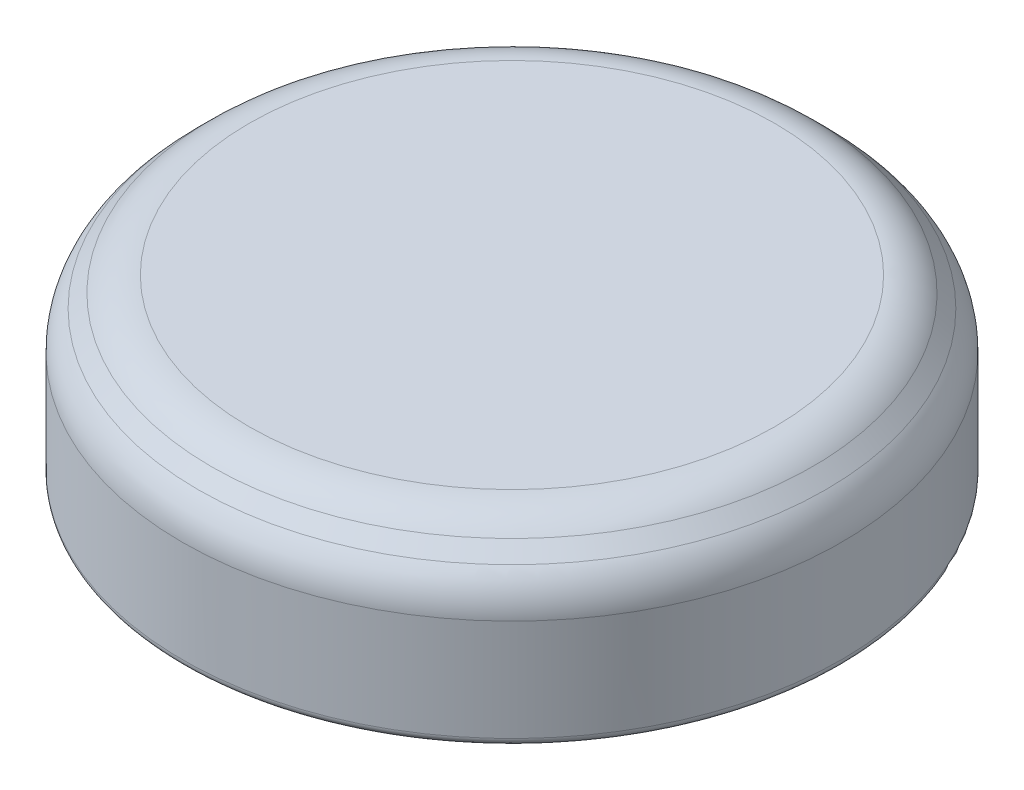
ISO-10303-21;
HEADER;
FILE_DESCRIPTION(('STEP AP214'),'2;1');
FILE_NAME('part.step','',(''),(''),'','','');
FILE_SCHEMA(('AUTOMOTIVE_DESIGN { 1 0 10303 214 1 1 1 1 }'));
ENDSEC;
DATA;
#1=APPLICATION_CONTEXT('core data for automotive mechanical design processes');
#2=APPLICATION_PROTOCOL_DEFINITION('international standard','automotive_design',2000,#1);
#3=PRODUCT_CONTEXT('',#1,'mechanical');
#4=PRODUCT('Part','Part','',(#3));
#5=PRODUCT_RELATED_PRODUCT_CATEGORY('part','',(#4));
#6=PRODUCT_DEFINITION_FORMATION('','',#4);
#7=PRODUCT_DEFINITION_CONTEXT('part definition',#1,'design');
#8=PRODUCT_DEFINITION('design','',#6,#7);
#9=PRODUCT_DEFINITION_SHAPE('','',#8);
#10=(LENGTH_UNIT() NAMED_UNIT(*) SI_UNIT(.MILLI.,.METRE.));
#11=(NAMED_UNIT(*) PLANE_ANGLE_UNIT() SI_UNIT($,.RADIAN.));
#12=(NAMED_UNIT(*) SI_UNIT($,.STERADIAN.) SOLID_ANGLE_UNIT());
#13=UNCERTAINTY_MEASURE_WITH_UNIT(LENGTH_MEASURE(1.E-05),#10,'distance_accuracy_value','');
#14=(GEOMETRIC_REPRESENTATION_CONTEXT(3) GLOBAL_UNCERTAINTY_ASSIGNED_CONTEXT((#13)) GLOBAL_UNIT_ASSIGNED_CONTEXT((#10,
#11,#12)) REPRESENTATION_CONTEXT('',''));
#15=CARTESIAN_POINT('',(0.,0.,0.));
#16=DIRECTION('',(0.,0.,1.));
#17=DIRECTION('',(1.,0.,0.));
#18=AXIS2_PLACEMENT_3D('',#15,#16,#17);
#19=CARTESIAN_POINT('',(0.,7.366,0.));
#20=DIRECTION('',(0.,-1.,0.));
#21=DIRECTION('',(0.,0.,-1.));
#22=AXIS2_PLACEMENT_3D('',#19,#20,#21);
#23=CYLINDRICAL_SURFACE('',#22,15.6591);
#24=CARTESIAN_POINT('',(0.,5.2107385309434,0.));
#25=DIRECTION('',(0.,1.,0.));
#26=DIRECTION('',(0.,0.,1.));
#27=AXIS2_PLACEMENT_3D('',#24,#25,#26);
#28=CIRCLE('',#27,15.6591);
#29=CARTESIAN_POINT('',(0.,5.2107385309434,15.6591));
#30=VERTEX_POINT('',#29);
#31=EDGE_CURVE('E53',#30,#30,#28,.F.);
#32=ORIENTED_EDGE('',*,*,#31,.T.);
#33=EDGE_LOOP('',(#32));
#34=FACE_BOUND('',#33,.T.);
#35=DIRECTION('',(0.,-1.,0.));
#36=VECTOR('',#35,1.);
#37=CARTESIAN_POINT('',(-2.54,7.366,-15.4517252373319));
#38=LINE('',#37,#36);
#39=CARTESIAN_POINT('',(-2.54,3.048,-15.4517252373319));
#40=VERTEX_POINT('',#39);
#41=CARTESIAN_POINT('',(-2.54,0.381,-15.4517252373319));
#42=VERTEX_POINT('',#41);
#43=EDGE_CURVE('E289',#40,#42,#38,.T.);
#44=ORIENTED_EDGE('',*,*,#43,.T.);
#45=CARTESIAN_POINT('',(0.,0.381,0.));
#46=DIRECTION('',(0.,1.,0.));
#47=DIRECTION('',(0.,0.,1.));
#48=AXIS2_PLACEMENT_3D('',#45,#46,#47);
#49=CIRCLE('',#48,15.6591);
#50=CARTESIAN_POINT('',(2.54,0.381,-15.4517252373319));
#51=VERTEX_POINT('',#50);
#52=EDGE_CURVE('E308',#42,#51,#49,.T.);
#53=ORIENTED_EDGE('',*,*,#52,.T.);
#54=DIRECTION('',(0.,-1.,0.));
#55=VECTOR('',#54,1.);
#56=CARTESIAN_POINT('',(2.54,7.366,-15.4517252373319));
#57=LINE('',#56,#55);
#58=CARTESIAN_POINT('',(2.54,3.048,-15.4517252373319));
#59=VERTEX_POINT('',#58);
#60=EDGE_CURVE('E278',#51,#59,#57,.F.);
#61=ORIENTED_EDGE('',*,*,#60,.T.);
#62=CARTESIAN_POINT('',(0.,3.048,0.));
#63=DIRECTION('',(0.,1.,0.));
#64=DIRECTION('',(0.,0.,1.));
#65=AXIS2_PLACEMENT_3D('',#62,#63,#64);
#66=CIRCLE('',#65,15.6591);
#67=EDGE_CURVE('E286',#59,#40,#66,.T.);
#68=ORIENTED_EDGE('',*,*,#67,.T.);
#69=EDGE_LOOP('',(#44,#53,#61,#68));
#70=FACE_BOUND('',#69,.T.);
#71=ADVANCED_FACE('F45',(#34,#70),#23,.T.);
#72=CARTESIAN_POINT('',(0.,8.382,0.));
#73=DIRECTION('',(0.,1.,0.));
#74=DIRECTION('',(0.,0.,1.));
#75=AXIS2_PLACEMENT_3D('',#72,#73,#74);
#76=PLANE('',#75);
#77=CARTESIAN_POINT('',(0.,8.382,0.));
#78=DIRECTION('',(0.,1.,0.));
#79=DIRECTION('',(0.,0.,1.));
#80=AXIS2_PLACEMENT_3D('',#77,#78,#79);
#81=CIRCLE('',#80,12.4878385309434);
#82=CARTESIAN_POINT('',(0.,8.382,12.4878385309434));
#83=VERTEX_POINT('',#82);
#84=EDGE_CURVE('E379',#83,#83,#81,.T.);
#85=ORIENTED_EDGE('',*,*,#84,.T.);
#86=EDGE_LOOP('',(#85));
#87=FACE_BOUND('',#86,.T.);
#88=ADVANCED_FACE('F398',(#87),#76,.T.);
#89=CARTESIAN_POINT('',(0.,0.,0.));
#90=DIRECTION('',(0.,1.,0.));
#91=DIRECTION('',(0.,0.,1.));
#92=AXIS2_PLACEMENT_3D('',#89,#90,#91);
#93=PLANE('',#92);
#94=DIRECTION('',(0.,0.,1.));
#95=VECTOR('',#94,1.);
#96=CARTESIAN_POINT('',(2.54,0.,-25.4));
#97=LINE('',#96,#95);
#98=CARTESIAN_POINT('',(2.54,0.,-15.0654817251225));
#99=VERTEX_POINT('',#98);
#100=CARTESIAN_POINT('',(2.54,0.,-14.421122619616));
#101=VERTEX_POINT('',#100);
#102=EDGE_CURVE('E282',#99,#101,#97,.T.);
#103=ORIENTED_EDGE('',*,*,#102,.F.);
#104=CARTESIAN_POINT('',(0.,0.,0.));
#105=DIRECTION('',(0.,1.,0.));
#106=DIRECTION('',(0.,0.,1.));
#107=AXIS2_PLACEMENT_3D('',#104,#105,#106);
#108=CIRCLE('',#107,15.2781);
#109=CARTESIAN_POINT('',(-2.54,0.,-15.0654817251225));
#110=VERTEX_POINT('',#109);
#111=EDGE_CURVE('E319',#99,#110,#108,.F.);
#112=ORIENTED_EDGE('',*,*,#111,.T.);
#113=DIRECTION('',(0.,0.,1.));
#114=VECTOR('',#113,1.);
#115=CARTESIAN_POINT('',(-2.54,0.,-25.4));
#116=LINE('',#115,#114);
#117=CARTESIAN_POINT('',(-2.54,0.,-14.421122619616));
#118=VERTEX_POINT('',#117);
#119=EDGE_CURVE('E270',#110,#118,#116,.T.);
#120=ORIENTED_EDGE('',*,*,#119,.T.);
#121=CARTESIAN_POINT('',(0.,0.,0.));
#122=DIRECTION('',(0.,1.,0.));
#123=DIRECTION('',(0.,0.,1.));
#124=AXIS2_PLACEMENT_3D('',#121,#122,#123);
#125=CIRCLE('',#124,14.6431);
#126=EDGE_CURVE('E292',#118,#101,#125,.T.);
#127=ORIENTED_EDGE('',*,*,#126,.T.);
#128=EDGE_LOOP('',(#103,#112,#120,#127));
#129=FACE_BOUND('',#128,.T.);
#130=ADVANCED_FACE('F403',(#129),#93,.F.);
#131=CARTESIAN_POINT('',(0.,8.08442048968553,0.));
#132=DIRECTION('',(0.,-1.,0.));
#133=DIRECTION('',(0.,0.,-1.));
#134=AXIS2_PLACEMENT_3D('',#131,#132,#133);
#135=CONICAL_SURFACE('',#134,13.8375204896855,0.785398163397448);
#136=CARTESIAN_POINT('',(0.,7.00678975515724,0.));
#137=DIRECTION('',(0.,-1.,0.));
#138=DIRECTION('',(0.,0.,-1.));
#139=AXIS2_PLACEMENT_3D('',#136,#137,#138);
#140=CIRCLE('',#139,14.9151512242138);
#141=CARTESIAN_POINT('',(0.,7.00678975515724,-14.9151512242138));
#142=VERTEX_POINT('',#141);
#143=EDGE_CURVE('E13',#142,#142,#140,.F.);
#144=ORIENTED_EDGE('',*,*,#143,.T.);
#145=EDGE_LOOP('',(#144));
#146=FACE_BOUND('',#145,.T.);
#147=CARTESIAN_POINT('',(0.,7.63805122421383,0.));
#148=DIRECTION('',(0.,1.,0.));
#149=DIRECTION('',(0.,0.,1.));
#150=AXIS2_PLACEMENT_3D('',#147,#148,#149);
#151=CIRCLE('',#150,14.2838897551572);
#152=CARTESIAN_POINT('',(0.,7.63805122421383,14.2838897551572));
#153=VERTEX_POINT('',#152);
#154=EDGE_CURVE('E382',#153,#153,#151,.F.);
#155=ORIENTED_EDGE('',*,*,#154,.T.);
#156=EDGE_LOOP('',(#155));
#157=FACE_BOUND('',#156,.T.);
#158=ADVANCED_FACE('F408',(#146,#157),#135,.T.);
#159=CARTESIAN_POINT('',(0.,7.366,0.));
#160=DIRECTION('',(0.,-1.,0.));
#161=DIRECTION('',(0.,0.,-1.));
#162=AXIS2_PLACEMENT_3D('',#159,#160,#161);
#163=CYLINDRICAL_SURFACE('',#162,14.6431);
#164=CARTESIAN_POINT('',(0.,4.064,0.));
#165=DIRECTION('',(0.,-1.,0.));
#166=DIRECTION('',(0.,0.,-1.));
#167=AXIS2_PLACEMENT_3D('',#164,#165,#166);
#168=CIRCLE('',#167,14.6431);
#169=CARTESIAN_POINT('',(-14.6217162715727,4.064,0.791069455627508));
#170=VERTEX_POINT('',#169);
#171=CARTESIAN_POINT('',(-14.6217162715727,4.064,-0.791069455627201));
#172=VERTEX_POINT('',#171);
#173=EDGE_CURVE('E377',#170,#172,#168,.T.);
#174=ORIENTED_EDGE('',*,*,#173,.F.);
#175=CARTESIAN_POINT('',(0.,19.1585044123123,0.));
#176=DIRECTION('',(0.,0.0523359562429438,0.998629534754574));
#177=DIRECTION('',(0.,-0.998629534754574,0.0523359562429438));
#178=AXIS2_PLACEMENT_3D('',#175,#176,#177);
#179=ELLIPSE('',#178,279.790435700203,14.6431);
#180=CARTESIAN_POINT('',(-14.6260123252327,5.6642,0.707206527218786));
#181=VERTEX_POINT('',#180);
#182=EDGE_CURVE('E375',#181,#170,#179,.T.);
#183=ORIENTED_EDGE('',*,*,#182,.F.);
#184=CARTESIAN_POINT('',(0.,5.6642,0.));
#185=DIRECTION('',(0.,1.,0.));
#186=DIRECTION('',(-1.,0.,0.));
#187=AXIS2_PLACEMENT_3D('',#184,#185,#186);
#188=CIRCLE('',#187,14.6431);
#189=CARTESIAN_POINT('',(-14.6260123252327,5.6642,-0.707206527218478));
#190=VERTEX_POINT('',#189);
#191=EDGE_CURVE('E373',#190,#181,#188,.T.);
#192=ORIENTED_EDGE('',*,*,#191,.F.);
#193=CARTESIAN_POINT('',(0.,19.1585044123123,0.));
#194=DIRECTION('',(0.,0.0523359562429438,-0.998629534754574));
#195=DIRECTION('',(0.,-0.998629534754574,-0.0523359562429438));
#196=AXIS2_PLACEMENT_3D('',#193,#194,#195);
#197=ELLIPSE('',#196,279.790435700203,14.6431);
#198=EDGE_CURVE('E191',#172,#190,#197,.T.);
#199=ORIENTED_EDGE('',*,*,#198,.F.);
#200=EDGE_LOOP('',(#174,#183,#192,#199));
#201=FACE_BOUND('',#200,.T.);
#202=CARTESIAN_POINT('',(0.,4.064,0.));
#203=DIRECTION('',(0.,-1.,0.));
#204=DIRECTION('',(0.,0.,-1.));
#205=AXIS2_PLACEMENT_3D('',#202,#203,#204);
#206=CIRCLE('',#205,14.6431);
#207=CARTESIAN_POINT('',(-0.791069455627355,4.064,-14.6217162715727));
#208=VERTEX_POINT('',#207);
#209=CARTESIAN_POINT('',(0.791069455627354,4.064,-14.6217162715727));
#210=VERTEX_POINT('',#209);
#211=EDGE_CURVE('E370',#208,#210,#206,.T.);
#212=ORIENTED_EDGE('',*,*,#211,.F.);
#213=CARTESIAN_POINT('',(0.,19.1585044123123,0.));
#214=DIRECTION('',(-0.998629534754574,0.0523359562429438,0.));
#215=DIRECTION('',(-0.0523359562429438,-0.998629534754574,0.));
#216=AXIS2_PLACEMENT_3D('',#213,#214,#215);
#217=ELLIPSE('',#216,279.790435700203,14.6431);
#218=CARTESIAN_POINT('',(-0.707206527218633,5.6642,-14.6260123252327));
#219=VERTEX_POINT('',#218);
#220=EDGE_CURVE('E368',#219,#208,#217,.T.);
#221=ORIENTED_EDGE('',*,*,#220,.F.);
#222=CARTESIAN_POINT('',(0.,5.6642,0.));
#223=DIRECTION('',(0.,1.,0.));
#224=DIRECTION('',(0.,0.,1.));
#225=AXIS2_PLACEMENT_3D('',#222,#223,#224);
#226=CIRCLE('',#225,14.6431);
#227=CARTESIAN_POINT('',(0.707206527218632,5.6642,-14.6260123252327));
#228=VERTEX_POINT('',#227);
#229=EDGE_CURVE('E366',#228,#219,#226,.T.);
#230=ORIENTED_EDGE('',*,*,#229,.F.);
#231=CARTESIAN_POINT('',(0.,19.1585044123123,0.));
#232=DIRECTION('',(0.998629534754574,0.0523359562429438,0.));
#233=DIRECTION('',(0.0523359562429438,-0.998629534754574,0.));
#234=AXIS2_PLACEMENT_3D('',#231,#232,#233);
#235=ELLIPSE('',#234,279.790435700203,14.6431);
#236=EDGE_CURVE('E364',#210,#228,#235,.T.);
#237=ORIENTED_EDGE('',*,*,#236,.F.);
#238=EDGE_LOOP('',(#212,#221,#230,#237));
#239=FACE_BOUND('',#238,.T.);
#240=CARTESIAN_POINT('',(0.,4.064,0.));
#241=DIRECTION('',(0.,-1.,0.));
#242=DIRECTION('',(0.,0.,-1.));
#243=AXIS2_PLACEMENT_3D('',#240,#241,#242);
#244=CIRCLE('',#243,14.6431);
#245=CARTESIAN_POINT('',(14.6217162715727,4.064,-0.791069455627406));
#246=VERTEX_POINT('',#245);
#247=CARTESIAN_POINT('',(14.6217162715727,4.064,0.791069455627303));
#248=VERTEX_POINT('',#247);
#249=EDGE_CURVE('E361',#246,#248,#244,.T.);
#250=ORIENTED_EDGE('',*,*,#249,.F.);
#251=CARTESIAN_POINT('',(0.,19.1585044123123,0.));
#252=DIRECTION('',(0.,0.0523359562429438,-0.998629534754574));
#253=DIRECTION('',(0.,-0.998629534754574,-0.0523359562429438));
#254=AXIS2_PLACEMENT_3D('',#251,#252,#253);
#255=ELLIPSE('',#254,279.790435700203,14.6431);
#256=CARTESIAN_POINT('',(14.6260123252327,5.6642,-0.707206527218684));
#257=VERTEX_POINT('',#256);
#258=EDGE_CURVE('E359',#257,#246,#255,.T.);
#259=ORIENTED_EDGE('',*,*,#258,.F.);
#260=CARTESIAN_POINT('',(0.,5.6642,0.));
#261=DIRECTION('',(0.,1.,0.));
#262=DIRECTION('',(-1.,0.,0.));
#263=AXIS2_PLACEMENT_3D('',#260,#261,#262);
#264=CIRCLE('',#263,14.6431);
#265=CARTESIAN_POINT('',(14.6260123252327,5.6642,0.707206527218581));
#266=VERTEX_POINT('',#265);
#267=EDGE_CURVE('E357',#266,#257,#264,.T.);
#268=ORIENTED_EDGE('',*,*,#267,.F.);
#269=CARTESIAN_POINT('',(0.,19.1585044123123,0.));
#270=DIRECTION('',(0.,0.0523359562429438,0.998629534754574));
#271=DIRECTION('',(0.,-0.998629534754574,0.0523359562429438));
#272=AXIS2_PLACEMENT_3D('',#269,#270,#271);
#273=ELLIPSE('',#272,279.790435700203,14.6431);
#274=EDGE_CURVE('E355',#248,#266,#273,.T.);
#275=ORIENTED_EDGE('',*,*,#274,.F.);
#276=EDGE_LOOP('',(#250,#259,#268,#275));
#277=FACE_BOUND('',#276,.T.);
#278=CARTESIAN_POINT('',(0.,4.064,0.));
#279=DIRECTION('',(0.,-1.,0.));
#280=DIRECTION('',(0.,0.,-1.));
#281=AXIS2_PLACEMENT_3D('',#278,#279,#280);
#282=CIRCLE('',#281,14.6431);
#283=CARTESIAN_POINT('',(0.791069455627355,4.064,14.6217162715727));
#284=VERTEX_POINT('',#283);
#285=CARTESIAN_POINT('',(-0.791069455627354,4.064,14.6217162715727));
#286=VERTEX_POINT('',#285);
#287=EDGE_CURVE('E352',#284,#286,#282,.T.);
#288=ORIENTED_EDGE('',*,*,#287,.F.);
#289=CARTESIAN_POINT('',(0.,19.1585044123123,0.));
#290=DIRECTION('',(0.998629534754574,0.0523359562429438,0.));
#291=DIRECTION('',(0.0523359562429438,-0.998629534754574,0.));
#292=AXIS2_PLACEMENT_3D('',#289,#290,#291);
#293=ELLIPSE('',#292,279.790435700203,14.6431);
#294=CARTESIAN_POINT('',(0.707206527218633,5.6642,14.6260123252327));
#295=VERTEX_POINT('',#294);
#296=EDGE_CURVE('E350',#295,#284,#293,.T.);
#297=ORIENTED_EDGE('',*,*,#296,.F.);
#298=CARTESIAN_POINT('',(0.,5.6642,0.));
#299=DIRECTION('',(0.,1.,0.));
#300=DIRECTION('',(0.,0.,1.));
#301=AXIS2_PLACEMENT_3D('',#298,#299,#300);
#302=CIRCLE('',#301,14.6431);
#303=CARTESIAN_POINT('',(-0.707206527218632,5.6642,14.6260123252327));
#304=VERTEX_POINT('',#303);
#305=EDGE_CURVE('E348',#304,#295,#302,.T.);
#306=ORIENTED_EDGE('',*,*,#305,.F.);
#307=CARTESIAN_POINT('',(0.,19.1585044123123,0.));
#308=DIRECTION('',(-0.998629534754574,0.0523359562429438,0.));
#309=DIRECTION('',(-0.0523359562429438,-0.998629534754574,0.));
#310=AXIS2_PLACEMENT_3D('',#307,#308,#309);
#311=ELLIPSE('',#310,279.790435700203,14.6431);
#312=EDGE_CURVE('E346',#286,#304,#311,.T.);
#313=ORIENTED_EDGE('',*,*,#312,.F.);
#314=EDGE_LOOP('',(#288,#297,#306,#313));
#315=FACE_BOUND('',#314,.T.);
#316=DIRECTION('',(0.,-1.,0.));
#317=VECTOR('',#316,1.);
#318=CARTESIAN_POINT('',(-2.54,7.366,-14.421122619616));
#319=LINE('',#318,#317);
#320=CARTESIAN_POINT('',(-2.54,3.048,-14.421122619616));
#321=VERTEX_POINT('',#320);
#322=EDGE_CURVE('E305',#321,#118,#319,.T.);
#323=ORIENTED_EDGE('',*,*,#322,.F.);
#324=CARTESIAN_POINT('',(0.,3.048,0.));
#325=DIRECTION('',(0.,1.,0.));
#326=DIRECTION('',(0.,0.,1.));
#327=AXIS2_PLACEMENT_3D('',#324,#325,#326);
#328=CIRCLE('',#327,14.6431);
#329=CARTESIAN_POINT('',(2.54,3.048,-14.421122619616));
#330=VERTEX_POINT('',#329);
#331=EDGE_CURVE('E303',#330,#321,#328,.T.);
#332=ORIENTED_EDGE('',*,*,#331,.F.);
#333=DIRECTION('',(0.,-1.,0.));
#334=VECTOR('',#333,1.);
#335=CARTESIAN_POINT('',(2.54,7.366,-14.421122619616));
#336=LINE('',#335,#334);
#337=EDGE_CURVE('E301',#101,#330,#336,.F.);
#338=ORIENTED_EDGE('',*,*,#337,.F.);
#339=ORIENTED_EDGE('',*,*,#126,.F.);
#340=EDGE_LOOP('',(#323,#332,#338,#339));
#341=FACE_BOUND('',#340,.T.);
#342=CARTESIAN_POINT('',(0.,5.842,0.));
#343=DIRECTION('',(0.,1.,0.));
#344=DIRECTION('',(0.,0.,1.));
#345=AXIS2_PLACEMENT_3D('',#342,#343,#344);
#346=CIRCLE('',#345,14.6431);
#347=CARTESIAN_POINT('',(0.,5.842,14.6431));
#348=VERTEX_POINT('',#347);
#349=EDGE_CURVE('E298',#348,#348,#346,.F.);
#350=ORIENTED_EDGE('',*,*,#349,.F.);
#351=EDGE_LOOP('',(#350));
#352=FACE_BOUND('',#351,.T.);
#353=ADVANCED_FACE('F410',(#201,#239,#277,#315,#341,#352),#163,.F.);
#354=CARTESIAN_POINT('',(0.,7.366,0.));
#355=DIRECTION('',(0.,1.,0.));
#356=DIRECTION('',(0.,0.,1.));
#357=AXIS2_PLACEMENT_3D('',#354,#355,#356);
#358=PLANE('',#357);
#359=CARTESIAN_POINT('',(0.,7.366,0.));
#360=DIRECTION('',(0.,1.,0.));
#361=DIRECTION('',(0.,0.,1.));
#362=AXIS2_PLACEMENT_3D('',#359,#360,#361);
#363=CIRCLE('',#362,13.1191);
#364=CARTESIAN_POINT('',(0.,7.366,13.1191));
#365=VERTEX_POINT('',#364);
#366=EDGE_CURVE('E295',#365,#365,#363,.T.);
#367=ORIENTED_EDGE('',*,*,#366,.F.);
#368=EDGE_LOOP('',(#367));
#369=FACE_BOUND('',#368,.T.);
#370=ADVANCED_FACE('F338',(#369),#358,.F.);
#371=CARTESIAN_POINT('',(0.,7.366,0.));
#372=DIRECTION('',(0.,-1.,0.));
#373=DIRECTION('',(0.,0.,-1.));
#374=AXIS2_PLACEMENT_3D('',#371,#372,#373);
#375=CONICAL_SURFACE('',#374,13.1191,0.785398163397448);
#376=ORIENTED_EDGE('',*,*,#349,.T.);
#377=EDGE_LOOP('',(#376));
#378=FACE_BOUND('',#377,.T.);
#379=ORIENTED_EDGE('',*,*,#366,.T.);
#380=EDGE_LOOP('',(#379));
#381=FACE_BOUND('',#380,.T.);
#382=ADVANCED_FACE('F336',(#378,#381),#375,.F.);
#383=CARTESIAN_POINT('',(-2.54,0.,-25.4));
#384=DIRECTION('',(-1.,0.,0.));
#385=DIRECTION('',(0.,-1.,0.));
#386=AXIS2_PLACEMENT_3D('',#383,#384,#385);
#387=PLANE('',#386);
#388=ORIENTED_EDGE('',*,*,#119,.F.);
#389=CARTESIAN_POINT('',(-2.54,0.,-15.0654817251225));
#390=CARTESIAN_POINT('',(-2.54,-1.7225422317726E-05,-15.0874335175876));
#391=CARTESIAN_POINT('',(-2.54,0.00184376258465478,-15.1093818382942));
#392=CARTESIAN_POINT('',(-2.54,0.00919882073363558,-15.1526533495357));
#393=CARTESIAN_POINT('',(-2.54,0.0146915700603824,-15.173976764396));
#394=CARTESIAN_POINT('',(-2.54,0.0291915571867706,-15.2154102263428));
#395=CARTESIAN_POINT('',(-2.54,0.038201016472197,-15.2355194971716));
#396=CARTESIAN_POINT('',(-2.54,0.0594868787289595,-15.2739209705587));
#397=CARTESIAN_POINT('',(-2.54,0.0717623099228591,-15.2922137113988));
#398=CARTESIAN_POINT('',(-2.54,0.0991551906744815,-15.3263300304729));
#399=CARTESIAN_POINT('',(-2.54,0.114253082413145,-15.342169305227));
#400=CARTESIAN_POINT('',(-2.54,0.146929104454111,-15.371051020832));
#401=CARTESIAN_POINT('',(-2.54,0.164507650988168,-15.3840929913928));
#402=CARTESIAN_POINT('',(-2.54,0.201398605825968,-15.4068256371085));
#403=CARTESIAN_POINT('',(-2.54,0.220685867512697,-15.4165571730314));
#404=CARTESIAN_POINT('',(-2.54,0.26062876436647,-15.4325935498973));
#405=CARTESIAN_POINT('',(-2.54,0.281283319454961,-15.4389010602127));
#406=CARTESIAN_POINT('',(-2.54,0.315241896564794,-15.4461673332976));
#407=CARTESIAN_POINT('',(-2.54,0.328315796659932,-15.4482503498726));
#408=CARTESIAN_POINT('',(-2.54,0.354591129350472,-15.4510289629907));
#409=CARTESIAN_POINT('',(-2.54,0.367792351298367,-15.4517265521848));
#410=CARTESIAN_POINT('',(-2.54,0.380999999999797,-15.4517252373329));
#411=B_SPLINE_CURVE_WITH_KNOTS('',3,(#389,#390,#391,#392,#393,#394,#395,#396,#397,#398,#399,
#400,#401,#402,#403,#404,#405,#406,#407,#408,#409,#410),.UNSPECIFIED.,.F.,.F.,(4,2,2,2,2,2,2,2,
2,2,4),(0.,0.0657720126096408,0.131520118105964,0.197309823698158,0.263079975665277,
0.328410227796389,0.39375145482387,0.458254127073134,0.522706440521001,0.562355500632072,
0.601947492340685),.UNSPECIFIED.);
#412=EDGE_CURVE('E340',#110,#42,#411,.T.);
#413=ORIENTED_EDGE('',*,*,#412,.T.);
#414=ORIENTED_EDGE('',*,*,#43,.F.);
#415=DIRECTION('',(0.,0.,1.));
#416=VECTOR('',#415,1.);
#417=CARTESIAN_POINT('',(-2.54,3.048,-25.4));
#418=LINE('',#417,#416);
#419=EDGE_CURVE('E275',#40,#321,#418,.T.);
#420=ORIENTED_EDGE('',*,*,#419,.T.);
#421=ORIENTED_EDGE('',*,*,#322,.T.);
#422=EDGE_LOOP('',(#388,#413,#414,#420,#421));
#423=FACE_BOUND('',#422,.T.);
#424=ADVANCED_FACE('F332',(#423),#387,.F.);
#425=CARTESIAN_POINT('',(-2.54,3.048,-25.4));
#426=DIRECTION('',(0.,1.,0.));
#427=DIRECTION('',(0.,0.,1.));
#428=AXIS2_PLACEMENT_3D('',#425,#426,#427);
#429=PLANE('',#428);
#430=DIRECTION('',(0.,0.,1.));
#431=VECTOR('',#430,1.);
#432=CARTESIAN_POINT('',(2.54,3.048,-25.4));
#433=LINE('',#432,#431);
#434=EDGE_CURVE('E279',#59,#330,#433,.T.);
#435=ORIENTED_EDGE('',*,*,#434,.T.);
#436=ORIENTED_EDGE('',*,*,#331,.T.);
#437=ORIENTED_EDGE('',*,*,#419,.F.);
#438=ORIENTED_EDGE('',*,*,#67,.F.);
#439=EDGE_LOOP('',(#435,#436,#437,#438));
#440=FACE_BOUND('',#439,.T.);
#441=ADVANCED_FACE('F329',(#440),#429,.F.);
#442=CARTESIAN_POINT('',(2.54,0.,-25.4));
#443=DIRECTION('',(1.,0.,0.));
#444=DIRECTION('',(0.,1.,0.));
#445=AXIS2_PLACEMENT_3D('',#442,#443,#444);
#446=PLANE('',#445);
#447=ORIENTED_EDGE('',*,*,#60,.F.);
#448=CARTESIAN_POINT('',(2.54,0.381,-15.4517252373319));
#449=CARTESIAN_POINT('',(2.54,0.359772490891304,-15.4517445966209));
#450=CARTESIAN_POINT('',(2.54,0.338552065598667,-15.4499285919333));
#451=CARTESIAN_POINT('',(2.54,0.296738615147839,-15.4427706701231));
#452=CARTESIAN_POINT('',(2.54,0.276144893476584,-15.4374328289169));
#453=CARTESIAN_POINT('',(2.54,0.236139244993674,-15.423372955196));
#454=CARTESIAN_POINT('',(2.54,0.216727738558609,-15.4146497269274));
#455=CARTESIAN_POINT('',(2.54,0.179634954507946,-15.3940883898612));
#456=CARTESIAN_POINT('',(2.54,0.161953551564202,-15.3822505069177));
#457=CARTESIAN_POINT('',(2.54,0.128705585184498,-15.3557305831975));
#458=CARTESIAN_POINT('',(2.54,0.113151656785205,-15.3410327083369));
#459=CARTESIAN_POINT('',(2.54,0.0846921536658857,-15.3092604523183));
#460=CARTESIAN_POINT('',(2.54,0.0717871500032159,-15.2921855600495));
#461=CARTESIAN_POINT('',(2.54,0.0488197071337167,-15.2559162402967));
#462=CARTESIAN_POINT('',(2.54,0.0387955636956408,-15.236697588268));
#463=CARTESIAN_POINT('',(2.54,0.0220747214168535,-15.1968671141949));
#464=CARTESIAN_POINT('',(2.54,0.0153767301925501,-15.1762558368001));
#465=CARTESIAN_POINT('',(2.54,0.00696106685302003,-15.1405387495994));
#466=CARTESIAN_POINT('',(2.54,0.00435210173695095,-15.1256364320892));
#467=CARTESIAN_POINT('',(2.54,0.000871658125725568,-15.0956517892088));
#468=CARTESIAN_POINT('',(2.54,-2.28805720678941E-06,-15.0805697502337));
#469=CARTESIAN_POINT('',(2.54,0.,-15.0654817251225));
#470=B_SPLINE_CURVE_WITH_KNOTS('',3,(#448,#449,#450,#451,#452,#453,#454,#455,#456,#457,#458,
#459,#460,#461,#462,#463,#464,#465,#466,#467,#468,#469),.UNSPECIFIED.,.F.,.F.,(4,2,2,2,2,2,2,2,
2,2,4),(0.,0.0635945245725837,0.127115578283884,0.190659088740896,0.2541979927132,
0.318099232539739,0.382014233812814,0.446743248535656,0.511447092943298,0.556738675021806,
0.60196579337516),.UNSPECIFIED.);
#471=EDGE_CURVE('E311',#51,#99,#470,.T.);
#472=ORIENTED_EDGE('',*,*,#471,.T.);
#473=ORIENTED_EDGE('',*,*,#102,.T.);
#474=ORIENTED_EDGE('',*,*,#337,.T.);
#475=ORIENTED_EDGE('',*,*,#434,.F.);
#476=EDGE_LOOP('',(#447,#472,#473,#474,#475));
#477=FACE_BOUND('',#476,.T.);
#478=ADVANCED_FACE('F324',(#477),#446,.F.);
#479=CARTESIAN_POINT('',(0.,0.381,0.));
#480=DIRECTION('',(0.,1.,0.));
#481=DIRECTION('',(0.,0.,1.));
#482=AXIS2_PLACEMENT_3D('',#479,#480,#481);
#483=TOROIDAL_SURFACE('',#482,15.2781,0.381);
#484=ORIENTED_EDGE('',*,*,#412,.F.);
#485=ORIENTED_EDGE('',*,*,#111,.F.);
#486=ORIENTED_EDGE('',*,*,#471,.F.);
#487=ORIENTED_EDGE('',*,*,#52,.F.);
#488=EDGE_LOOP('',(#484,#485,#486,#487));
#489=FACE_BOUND('',#488,.T.);
#490=ADVANCED_FACE('F321',(#489),#483,.T.);
#491=CARTESIAN_POINT('',(0.,4.064,14.351));
#492=DIRECTION('',(0.,-1.,0.));
#493=DIRECTION('',(0.,0.,-1.));
#494=AXIS2_PLACEMENT_3D('',#491,#492,#493);
#495=PLANE('',#494);
#496=ORIENTED_EDGE('',*,*,#287,.T.);
#497=DIRECTION('',(0.,0.,-1.));
#498=VECTOR('',#497,1.);
#499=CARTESIAN_POINT('',(-0.791069455627354,4.064,14.2621));
#500=LINE('',#499,#498);
#501=CARTESIAN_POINT('',(-0.791069455627354,4.064,15.1892));
#502=VERTEX_POINT('',#501);
#503=EDGE_CURVE('E266',#502,#286,#500,.T.);
#504=ORIENTED_EDGE('',*,*,#503,.F.);
#505=DIRECTION('',(-1.,0.,0.));
#506=VECTOR('',#505,1.);
#507=CARTESIAN_POINT('',(0.,4.064,15.1892));
#508=LINE('',#507,#506);
#509=CARTESIAN_POINT('',(0.791069455627355,4.064,15.1892));
#510=VERTEX_POINT('',#509);
#511=EDGE_CURVE('E271',#510,#502,#508,.T.);
#512=ORIENTED_EDGE('',*,*,#511,.F.);
#513=DIRECTION('',(0.,0.,1.));
#514=VECTOR('',#513,1.);
#515=CARTESIAN_POINT('',(0.791069455627355,4.064,14.2621));
#516=LINE('',#515,#514);
#517=EDGE_CURVE('E268',#284,#510,#516,.T.);
#518=ORIENTED_EDGE('',*,*,#517,.F.);
#519=EDGE_LOOP('',(#496,#504,#512,#518));
#520=FACE_BOUND('',#519,.T.);
#521=ADVANCED_FACE('F475',(#520),#495,.F.);
#522=CARTESIAN_POINT('',(0.707206527218633,5.6642,14.2621));
#523=DIRECTION('',(0.998629534754574,0.0523359562429438,0.));
#524=DIRECTION('',(0.0523359562429438,-0.998629534754574,0.));
#525=AXIS2_PLACEMENT_3D('',#522,#523,#524);
#526=PLANE('',#525);
#527=ORIENTED_EDGE('',*,*,#296,.T.);
#528=ORIENTED_EDGE('',*,*,#517,.T.);
#529=DIRECTION('',(0.0523359562429438,-0.998629534754574,0.));
#530=VECTOR('',#529,1.);
#531=CARTESIAN_POINT('',(0.705269451542461,5.70116160575151,15.1892));
#532=LINE('',#531,#530);
#533=CARTESIAN_POINT('',(0.707206527218633,5.6642,15.1892));
#534=VERTEX_POINT('',#533);
#535=EDGE_CURVE('E263',#534,#510,#532,.T.);
#536=ORIENTED_EDGE('',*,*,#535,.F.);
#537=DIRECTION('',(0.,0.,-1.));
#538=VECTOR('',#537,1.);
#539=CARTESIAN_POINT('',(0.707206527218633,5.6642,14.2621));
#540=LINE('',#539,#538);
#541=EDGE_CURVE('E251',#534,#295,#540,.T.);
#542=ORIENTED_EDGE('',*,*,#541,.T.);
#543=EDGE_LOOP('',(#527,#528,#536,#542));
#544=FACE_BOUND('',#543,.T.);
#545=ADVANCED_FACE('F481',(#544),#526,.F.);
#546=CARTESIAN_POINT('',(0.,5.6642,15.1892));
#547=DIRECTION('',(0.,0.,1.));
#548=DIRECTION('',(0.,-1.,0.));
#549=AXIS2_PLACEMENT_3D('',#546,#547,#548);
#550=PLANE('',#549);
#551=ORIENTED_EDGE('',*,*,#535,.T.);
#552=ORIENTED_EDGE('',*,*,#511,.T.);
#553=DIRECTION('',(-0.0523359562429438,-0.998629534754574,0.));
#554=VECTOR('',#553,1.);
#555=CARTESIAN_POINT('',(-0.707206527218632,5.6642,15.1892));
#556=LINE('',#555,#554);
#557=CARTESIAN_POINT('',(-0.707206527218632,5.6642,15.1892));
#558=VERTEX_POINT('',#557);
#559=EDGE_CURVE('E258',#558,#502,#556,.T.);
#560=ORIENTED_EDGE('',*,*,#559,.F.);
#561=DIRECTION('',(1.,0.,0.));
#562=VECTOR('',#561,1.);
#563=CARTESIAN_POINT('',(0.,5.6642,15.1892));
#564=LINE('',#563,#562);
#565=EDGE_CURVE('E259',#558,#534,#564,.T.);
#566=ORIENTED_EDGE('',*,*,#565,.T.);
#567=EDGE_LOOP('',(#551,#552,#560,#566));
#568=FACE_BOUND('',#567,.T.);
#569=ADVANCED_FACE('F488',(#568),#550,.F.);
#570=CARTESIAN_POINT('',(0.,5.6642,14.2621));
#571=DIRECTION('',(0.,1.,0.));
#572=DIRECTION('',(1.,0.,0.));
#573=AXIS2_PLACEMENT_3D('',#570,#571,#572);
#574=PLANE('',#573);
#575=ORIENTED_EDGE('',*,*,#305,.T.);
#576=ORIENTED_EDGE('',*,*,#541,.F.);
#577=ORIENTED_EDGE('',*,*,#565,.F.);
#578=DIRECTION('',(0.,0.,1.));
#579=VECTOR('',#578,1.);
#580=CARTESIAN_POINT('',(-0.707206527218632,5.6642,14.2621));
#581=LINE('',#580,#579);
#582=EDGE_CURVE('E256',#304,#558,#581,.T.);
#583=ORIENTED_EDGE('',*,*,#582,.F.);
#584=EDGE_LOOP('',(#575,#576,#577,#583));
#585=FACE_BOUND('',#584,.T.);
#586=ADVANCED_FACE('F496',(#585),#574,.F.);
#587=CARTESIAN_POINT('',(-0.707206527218632,5.6642,14.2621));
#588=DIRECTION('',(-0.998629534754574,0.0523359562429438,0.));
#589=DIRECTION('',(0.0523359562429438,0.998629534754574,0.));
#590=AXIS2_PLACEMENT_3D('',#587,#588,#589);
#591=PLANE('',#590);
#592=ORIENTED_EDGE('',*,*,#312,.T.);
#593=ORIENTED_EDGE('',*,*,#582,.T.);
#594=ORIENTED_EDGE('',*,*,#559,.T.);
#595=ORIENTED_EDGE('',*,*,#503,.T.);
#596=EDGE_LOOP('',(#592,#593,#594,#595));
#597=FACE_BOUND('',#596,.T.);
#598=ADVANCED_FACE('F504',(#597),#591,.F.);
#599=CARTESIAN_POINT('',(14.351,4.064,0.));
#600=DIRECTION('',(0.,-1.,0.));
#601=DIRECTION('',(-1.,0.,0.));
#602=AXIS2_PLACEMENT_3D('',#599,#600,#601);
#603=PLANE('',#602);
#604=ORIENTED_EDGE('',*,*,#249,.T.);
#605=DIRECTION('',(-1.,0.,0.));
#606=VECTOR('',#605,1.);
#607=CARTESIAN_POINT('',(14.2621,4.064,0.791069455627304));
#608=LINE('',#607,#606);
#609=CARTESIAN_POINT('',(15.1892,4.064,0.791069455627301));
#610=VERTEX_POINT('',#609);
#611=EDGE_CURVE('E247',#610,#248,#608,.T.);
#612=ORIENTED_EDGE('',*,*,#611,.F.);
#613=DIRECTION('',(0.,0.,1.));
#614=VECTOR('',#613,1.);
#615=CARTESIAN_POINT('',(15.1892,4.064,0.));
#616=LINE('',#615,#614);
#617=CARTESIAN_POINT('',(15.1892,4.064,-0.791069455627408));
#618=VERTEX_POINT('',#617);
#619=EDGE_CURVE('E252',#618,#610,#616,.T.);
#620=ORIENTED_EDGE('',*,*,#619,.F.);
#621=DIRECTION('',(1.,0.,0.));
#622=VECTOR('',#621,1.);
#623=CARTESIAN_POINT('',(14.2621,4.064,-0.791069455627405));
#624=LINE('',#623,#622);
#625=EDGE_CURVE('E249',#246,#618,#624,.T.);
#626=ORIENTED_EDGE('',*,*,#625,.F.);
#627=EDGE_LOOP('',(#604,#612,#620,#626));
#628=FACE_BOUND('',#627,.T.);
#629=ADVANCED_FACE('F512',(#628),#603,.F.);
#630=CARTESIAN_POINT('',(14.2621,5.6642,-0.707206527218682));
#631=DIRECTION('',(0.,0.0523359562429438,-0.998629534754574));
#632=DIRECTION('',(0.,-0.998629534754574,-0.0523359562429438));
#633=AXIS2_PLACEMENT_3D('',#630,#631,#632);
#634=PLANE('',#633);
#635=ORIENTED_EDGE('',*,*,#258,.T.);
#636=ORIENTED_EDGE('',*,*,#625,.T.);
#637=DIRECTION('',(0.,-0.998629534754574,-0.0523359562429438));
#638=VECTOR('',#637,1.);
#639=CARTESIAN_POINT('',(15.1892,5.70116160575151,-0.705269451542514));
#640=LINE('',#639,#638);
#641=CARTESIAN_POINT('',(15.1892,5.6642,-0.707206527218686));
#642=VERTEX_POINT('',#641);
#643=EDGE_CURVE('E244',#642,#618,#640,.T.);
#644=ORIENTED_EDGE('',*,*,#643,.F.);
#645=DIRECTION('',(-1.,0.,0.));
#646=VECTOR('',#645,1.);
#647=CARTESIAN_POINT('',(14.2621,5.6642,-0.707206527218682));
#648=LINE('',#647,#646);
#649=EDGE_CURVE('E232',#642,#257,#648,.T.);
#650=ORIENTED_EDGE('',*,*,#649,.T.);
#651=EDGE_LOOP('',(#635,#636,#644,#650));
#652=FACE_BOUND('',#651,.T.);
#653=ADVANCED_FACE('F520',(#652),#634,.F.);
#654=CARTESIAN_POINT('',(15.1892,5.6642,0.));
#655=DIRECTION('',(1.,0.,0.));
#656=DIRECTION('',(0.,-1.,0.));
#657=AXIS2_PLACEMENT_3D('',#654,#655,#656);
#658=PLANE('',#657);
#659=ORIENTED_EDGE('',*,*,#643,.T.);
#660=ORIENTED_EDGE('',*,*,#619,.T.);
#661=DIRECTION('',(0.,-0.998629534754574,0.0523359562429438));
#662=VECTOR('',#661,1.);
#663=CARTESIAN_POINT('',(15.1892,5.6642,0.707206527218579));
#664=LINE('',#663,#662);
#665=CARTESIAN_POINT('',(15.1892,5.6642,0.707206527218579));
#666=VERTEX_POINT('',#665);
#667=EDGE_CURVE('E239',#666,#610,#664,.T.);
#668=ORIENTED_EDGE('',*,*,#667,.F.);
#669=DIRECTION('',(0.,0.,-1.));
#670=VECTOR('',#669,1.);
#671=CARTESIAN_POINT('',(15.1892,5.6642,0.));
#672=LINE('',#671,#670);
#673=EDGE_CURVE('E240',#666,#642,#672,.T.);
#674=ORIENTED_EDGE('',*,*,#673,.T.);
#675=EDGE_LOOP('',(#659,#660,#668,#674));
#676=FACE_BOUND('',#675,.T.);
#677=ADVANCED_FACE('F528',(#676),#658,.F.);
#678=CARTESIAN_POINT('',(14.2621,5.6642,0.));
#679=DIRECTION('',(0.,1.,0.));
#680=DIRECTION('',(0.,0.,-1.));
#681=AXIS2_PLACEMENT_3D('',#678,#679,#680);
#682=PLANE('',#681);
#683=ORIENTED_EDGE('',*,*,#267,.T.);
#684=ORIENTED_EDGE('',*,*,#649,.F.);
#685=ORIENTED_EDGE('',*,*,#673,.F.);
#686=DIRECTION('',(1.,0.,0.));
#687=VECTOR('',#686,1.);
#688=CARTESIAN_POINT('',(14.2621,5.6642,0.707206527218582));
#689=LINE('',#688,#687);
#690=EDGE_CURVE('E237',#266,#666,#689,.T.);
#691=ORIENTED_EDGE('',*,*,#690,.F.);
#692=EDGE_LOOP('',(#683,#684,#685,#691));
#693=FACE_BOUND('',#692,.T.);
#694=ADVANCED_FACE('F536',(#693),#682,.F.);
#695=CARTESIAN_POINT('',(14.2621,5.6642,0.707206527218582));
#696=DIRECTION('',(0.,0.0523359562429438,0.998629534754574));
#697=DIRECTION('',(0.,0.998629534754574,-0.0523359562429438));
#698=AXIS2_PLACEMENT_3D('',#695,#696,#697);
#699=PLANE('',#698);
#700=ORIENTED_EDGE('',*,*,#274,.T.);
#701=ORIENTED_EDGE('',*,*,#690,.T.);
#702=ORIENTED_EDGE('',*,*,#667,.T.);
#703=ORIENTED_EDGE('',*,*,#611,.T.);
#704=EDGE_LOOP('',(#700,#701,#702,#703));
#705=FACE_BOUND('',#704,.T.);
#706=ADVANCED_FACE('F544',(#705),#699,.F.);
#707=CARTESIAN_POINT('',(0.,4.064,-14.351));
#708=DIRECTION('',(0.,-1.,0.));
#709=DIRECTION('',(0.,0.,1.));
#710=AXIS2_PLACEMENT_3D('',#707,#708,#709);
#711=PLANE('',#710);
#712=ORIENTED_EDGE('',*,*,#211,.T.);
#713=DIRECTION('',(0.,0.,1.));
#714=VECTOR('',#713,1.);
#715=CARTESIAN_POINT('',(0.791069455627354,4.064,-14.2621));
#716=LINE('',#715,#714);
#717=CARTESIAN_POINT('',(0.791069455627354,4.064,-15.1892));
#718=VERTEX_POINT('',#717);
#719=EDGE_CURVE('E68',#718,#210,#716,.T.);
#720=ORIENTED_EDGE('',*,*,#719,.F.);
#721=DIRECTION('',(1.,0.,0.));
#722=VECTOR('',#721,1.);
#723=CARTESIAN_POINT('',(0.,4.064,-15.1892));
#724=LINE('',#723,#722);
#725=CARTESIAN_POINT('',(-0.791069455627355,4.064,-15.1892));
#726=VERTEX_POINT('',#725);
#727=EDGE_CURVE('E233',#726,#718,#724,.T.);
#728=ORIENTED_EDGE('',*,*,#727,.F.);
#729=DIRECTION('',(0.,0.,-1.));
#730=VECTOR('',#729,1.);
#731=CARTESIAN_POINT('',(-0.791069455627355,4.064,-14.2621));
#732=LINE('',#731,#730);
#733=EDGE_CURVE('E230',#208,#726,#732,.T.);
#734=ORIENTED_EDGE('',*,*,#733,.F.);
#735=EDGE_LOOP('',(#712,#720,#728,#734));
#736=FACE_BOUND('',#735,.T.);
#737=ADVANCED_FACE('F552',(#736),#711,.F.);
#738=CARTESIAN_POINT('',(-0.707206527218633,5.6642,-14.2621));
#739=DIRECTION('',(-0.998629534754574,0.0523359562429438,0.));
#740=DIRECTION('',(-0.0523359562429438,-0.998629534754574,0.));
#741=AXIS2_PLACEMENT_3D('',#738,#739,#740);
#742=PLANE('',#741);
#743=ORIENTED_EDGE('',*,*,#220,.T.);
#744=ORIENTED_EDGE('',*,*,#733,.T.);
#745=DIRECTION('',(-0.0523359562429438,-0.998629534754574,0.));
#746=VECTOR('',#745,1.);
#747=CARTESIAN_POINT('',(-0.705269451542461,5.70116160575151,-15.1892));
#748=LINE('',#747,#746);
#749=CARTESIAN_POINT('',(-0.707206527218633,5.6642,-15.1892));
#750=VERTEX_POINT('',#749);
#751=EDGE_CURVE('E226',#750,#726,#748,.T.);
#752=ORIENTED_EDGE('',*,*,#751,.F.);
#753=DIRECTION('',(0.,0.,1.));
#754=VECTOR('',#753,1.);
#755=CARTESIAN_POINT('',(-0.707206527218633,5.6642,-14.2621));
#756=LINE('',#755,#754);
#757=EDGE_CURVE('E216',#750,#219,#756,.T.);
#758=ORIENTED_EDGE('',*,*,#757,.T.);
#759=EDGE_LOOP('',(#743,#744,#752,#758));
#760=FACE_BOUND('',#759,.T.);
#761=ADVANCED_FACE('F560',(#760),#742,.F.);
#762=CARTESIAN_POINT('',(0.,5.6642,-15.1892));
#763=DIRECTION('',(0.,0.,-1.));
#764=DIRECTION('',(0.,-1.,0.));
#765=AXIS2_PLACEMENT_3D('',#762,#763,#764);
#766=PLANE('',#765);
#767=ORIENTED_EDGE('',*,*,#751,.T.);
#768=ORIENTED_EDGE('',*,*,#727,.T.);
#769=DIRECTION('',(0.0523359562429438,-0.998629534754574,0.));
#770=VECTOR('',#769,1.);
#771=CARTESIAN_POINT('',(0.707206527218632,5.6642,-15.1892));
#772=LINE('',#771,#770);
#773=CARTESIAN_POINT('',(0.707206527218632,5.6642,-15.1892));
#774=VERTEX_POINT('',#773);
#775=EDGE_CURVE('E221',#774,#718,#772,.T.);
#776=ORIENTED_EDGE('',*,*,#775,.F.);
#777=DIRECTION('',(-1.,0.,0.));
#778=VECTOR('',#777,1.);
#779=CARTESIAN_POINT('',(0.,5.6642,-15.1892));
#780=LINE('',#779,#778);
#781=EDGE_CURVE('E222',#774,#750,#780,.T.);
#782=ORIENTED_EDGE('',*,*,#781,.T.);
#783=EDGE_LOOP('',(#767,#768,#776,#782));
#784=FACE_BOUND('',#783,.T.);
#785=ADVANCED_FACE('F568',(#784),#766,.F.);
#786=CARTESIAN_POINT('',(0.,5.6642,-14.2621));
#787=DIRECTION('',(0.,1.,0.));
#788=DIRECTION('',(-1.,0.,0.));
#789=AXIS2_PLACEMENT_3D('',#786,#787,#788);
#790=PLANE('',#789);
#791=ORIENTED_EDGE('',*,*,#229,.T.);
#792=ORIENTED_EDGE('',*,*,#757,.F.);
#793=ORIENTED_EDGE('',*,*,#781,.F.);
#794=DIRECTION('',(0.,0.,-1.));
#795=VECTOR('',#794,1.);
#796=CARTESIAN_POINT('',(0.707206527218632,5.6642,-14.2621));
#797=LINE('',#796,#795);
#798=EDGE_CURVE('E219',#228,#774,#797,.T.);
#799=ORIENTED_EDGE('',*,*,#798,.F.);
#800=EDGE_LOOP('',(#791,#792,#793,#799));
#801=FACE_BOUND('',#800,.T.);
#802=ADVANCED_FACE('F576',(#801),#790,.F.);
#803=CARTESIAN_POINT('',(0.707206527218632,5.6642,-14.2621));
#804=DIRECTION('',(0.998629534754574,0.0523359562429438,0.));
#805=DIRECTION('',(-0.0523359562429438,0.998629534754574,0.));
#806=AXIS2_PLACEMENT_3D('',#803,#804,#805);
#807=PLANE('',#806);
#808=ORIENTED_EDGE('',*,*,#236,.T.);
#809=ORIENTED_EDGE('',*,*,#798,.T.);
#810=ORIENTED_EDGE('',*,*,#775,.T.);
#811=ORIENTED_EDGE('',*,*,#719,.T.);
#812=EDGE_LOOP('',(#808,#809,#810,#811));
#813=FACE_BOUND('',#812,.T.);
#814=ADVANCED_FACE('F584',(#813),#807,.F.);
#815=CARTESIAN_POINT('',(-14.351,4.064,1.50860847167456E-13));
#816=DIRECTION('',(0.,-1.,0.));
#817=DIRECTION('',(1.,0.,0.));
#818=AXIS2_PLACEMENT_3D('',#815,#816,#817);
#819=PLANE('',#818);
#820=ORIENTED_EDGE('',*,*,#173,.T.);
#821=DIRECTION('',(1.,0.,0.));
#822=VECTOR('',#821,1.);
#823=CARTESIAN_POINT('',(-14.2621,4.064,-0.791069455627205));
#824=LINE('',#823,#822);
#825=CARTESIAN_POINT('',(-15.1892,4.064,-0.791069455627195));
#826=VERTEX_POINT('',#825);
#827=EDGE_CURVE('E60',#826,#172,#824,.T.);
#828=ORIENTED_EDGE('',*,*,#827,.F.);
#829=DIRECTION('',(0.,0.,-1.));
#830=VECTOR('',#829,1.);
#831=CARTESIAN_POINT('',(-15.1892,4.064,1.59640526142111E-13));
#832=LINE('',#831,#830);
#833=CARTESIAN_POINT('',(-15.1892,4.064,0.791069455627514));
#834=VERTEX_POINT('',#833);
#835=EDGE_CURVE('E203',#834,#826,#832,.T.);
#836=ORIENTED_EDGE('',*,*,#835,.F.);
#837=DIRECTION('',(-1.,0.,0.));
#838=VECTOR('',#837,1.);
#839=CARTESIAN_POINT('',(-14.2621,4.064,0.791069455627505));
#840=LINE('',#839,#838);
#841=EDGE_CURVE('E214',#170,#834,#840,.T.);
#842=ORIENTED_EDGE('',*,*,#841,.F.);
#843=EDGE_LOOP('',(#820,#828,#836,#842));
#844=FACE_BOUND('',#843,.T.);
#845=ADVANCED_FACE('F592',(#844),#819,.F.);
#846=CARTESIAN_POINT('',(-14.2621,5.6642,0.707206527218782));
#847=DIRECTION('',(0.,0.0523359562429438,0.998629534754574));
#848=DIRECTION('',(0.,-0.998629534754574,0.0523359562429438));
#849=AXIS2_PLACEMENT_3D('',#846,#847,#848);
#850=PLANE('',#849);
#851=ORIENTED_EDGE('',*,*,#182,.T.);
#852=ORIENTED_EDGE('',*,*,#841,.T.);
#853=DIRECTION('',(0.,-0.998629534754574,0.0523359562429438));
#854=VECTOR('',#853,1.);
#855=CARTESIAN_POINT('',(-15.1892,5.70116160575151,0.70526945154262));
#856=LINE('',#855,#854);
#857=CARTESIAN_POINT('',(-15.1892,5.6642,0.707206527218792));
#858=VERTEX_POINT('',#857);
#859=EDGE_CURVE('E204',#858,#834,#856,.T.);
#860=ORIENTED_EDGE('',*,*,#859,.F.);
#861=DIRECTION('',(1.,0.,0.));
#862=VECTOR('',#861,1.);
#863=CARTESIAN_POINT('',(-14.2621,5.6642,0.707206527218782));
#864=LINE('',#863,#862);
#865=EDGE_CURVE('E209',#858,#181,#864,.T.);
#866=ORIENTED_EDGE('',*,*,#865,.T.);
#867=EDGE_LOOP('',(#851,#852,#860,#866));
#868=FACE_BOUND('',#867,.T.);
#869=ADVANCED_FACE('F599',(#868),#850,.F.);
#870=CARTESIAN_POINT('',(-15.1892,5.6642,1.59640526142111E-13));
#871=DIRECTION('',(-1.,0.,0.));
#872=DIRECTION('',(0.,-1.,0.));
#873=AXIS2_PLACEMENT_3D('',#870,#871,#872);
#874=PLANE('',#873);
#875=ORIENTED_EDGE('',*,*,#859,.T.);
#876=ORIENTED_EDGE('',*,*,#835,.T.);
#877=DIRECTION('',(0.,-0.998629534754574,-0.0523359562429438));
#878=VECTOR('',#877,1.);
#879=CARTESIAN_POINT('',(-15.1892,5.6642,-0.707206527218473));
#880=LINE('',#879,#878);
#881=CARTESIAN_POINT('',(-15.1892,5.6642,-0.707206527218473));
#882=VERTEX_POINT('',#881);
#883=EDGE_CURVE('E189',#882,#826,#880,.T.);
#884=ORIENTED_EDGE('',*,*,#883,.F.);
#885=DIRECTION('',(0.,0.,1.));
#886=VECTOR('',#885,1.);
#887=CARTESIAN_POINT('',(-15.1892,5.6642,1.59640526142111E-13));
#888=LINE('',#887,#886);
#889=EDGE_CURVE('E195',#882,#858,#888,.T.);
#890=ORIENTED_EDGE('',*,*,#889,.T.);
#891=EDGE_LOOP('',(#875,#876,#884,#890));
#892=FACE_BOUND('',#891,.T.);
#893=ADVANCED_FACE('F200',(#892),#874,.F.);
#894=CARTESIAN_POINT('',(-14.2621,5.6642,1.49929669094387E-13));
#895=DIRECTION('',(0.,1.,0.));
#896=DIRECTION('',(0.,0.,1.));
#897=AXIS2_PLACEMENT_3D('',#894,#895,#896);
#898=PLANE('',#897);
#899=ORIENTED_EDGE('',*,*,#191,.T.);
#900=ORIENTED_EDGE('',*,*,#865,.F.);
#901=ORIENTED_EDGE('',*,*,#889,.F.);
#902=DIRECTION('',(-1.,0.,0.));
#903=VECTOR('',#902,1.);
#904=CARTESIAN_POINT('',(-14.2621,5.6642,-0.707206527218482));
#905=LINE('',#904,#903);
#906=EDGE_CURVE('E186',#190,#882,#905,.T.);
#907=ORIENTED_EDGE('',*,*,#906,.F.);
#908=EDGE_LOOP('',(#899,#900,#901,#907));
#909=FACE_BOUND('',#908,.T.);
#910=ADVANCED_FACE('F207',(#909),#898,.F.);
#911=CARTESIAN_POINT('',(-14.2621,5.6642,-0.707206527218482));
#912=DIRECTION('',(0.,0.0523359562429438,-0.998629534754574));
#913=DIRECTION('',(0.,0.998629534754574,0.0523359562429438));
#914=AXIS2_PLACEMENT_3D('',#911,#912,#913);
#915=PLANE('',#914);
#916=ORIENTED_EDGE('',*,*,#198,.T.);
#917=ORIENTED_EDGE('',*,*,#906,.T.);
#918=ORIENTED_EDGE('',*,*,#883,.T.);
#919=ORIENTED_EDGE('',*,*,#827,.T.);
#920=EDGE_LOOP('',(#916,#917,#918,#919));
#921=FACE_BOUND('',#920,.T.);
#922=ADVANCED_FACE('F188',(#921),#915,.F.);
#923=CARTESIAN_POINT('',(0.,5.842,0.));
#924=DIRECTION('',(0.,1.,0.));
#925=DIRECTION('',(0.,0.,1.));
#926=AXIS2_PLACEMENT_3D('',#923,#924,#925);
#927=TOROIDAL_SURFACE('',#926,12.4878385309434,2.54);
#928=ORIENTED_EDGE('',*,*,#154,.F.);
#929=EDGE_LOOP('',(#928));
#930=FACE_BOUND('',#929,.T.);
#931=ORIENTED_EDGE('',*,*,#84,.F.);
#932=EDGE_LOOP('',(#931));
#933=FACE_BOUND('',#932,.T.);
#934=ADVANCED_FACE('F390',(#930,#933),#927,.T.);
#935=CARTESIAN_POINT('',(0.,5.2107385309434,0.));
#936=DIRECTION('',(0.,1.,0.));
#937=DIRECTION('',(0.,0.,1.));
#938=AXIS2_PLACEMENT_3D('',#935,#936,#937);
#939=TOROIDAL_SURFACE('',#938,13.1191,2.54);
#940=ORIENTED_EDGE('',*,*,#143,.F.);
#941=EDGE_LOOP('',(#940));
#942=FACE_BOUND('',#941,.T.);
#943=ORIENTED_EDGE('',*,*,#31,.F.);
#944=EDGE_LOOP('',(#943));
#945=FACE_BOUND('',#944,.T.);
#946=ADVANCED_FACE('F47',(#942,#945),#939,.T.);
#947=CLOSED_SHELL('',(#71,#88,#130,#158,#353,#370,#382,#424,#441,#478,#490,#521,#545,#569,#586,
#598,#629,#653,#677,#694,#706,#737,#761,#785,#802,#814,#845,#869,#893,#910,#922,#934,#946));
#948=MANIFOLD_SOLID_BREP('B2',#947);
#949=ADVANCED_BREP_SHAPE_REPRESENTATION('',(#18,#948),#14);
#950=SHAPE_DEFINITION_REPRESENTATION(#9,#949);
ENDSEC;
END-ISO-10303-21;
